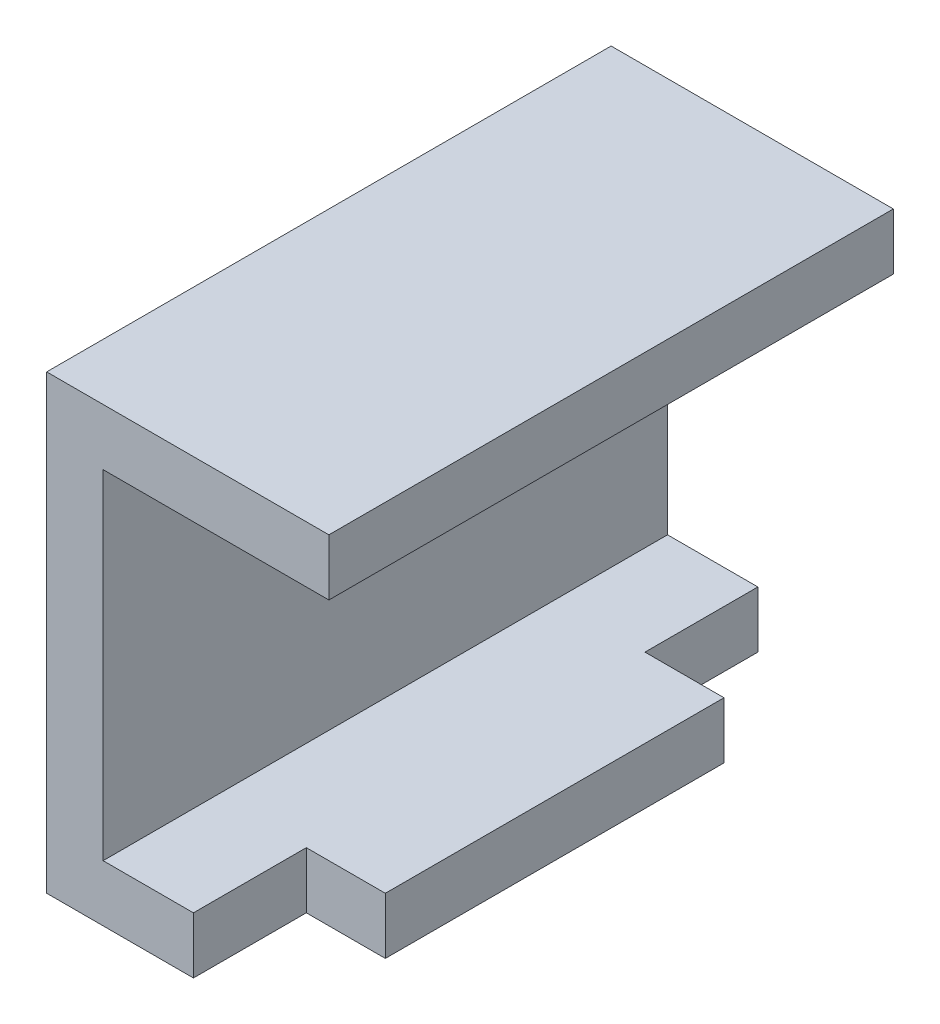
ISO-10303-21;
HEADER;
FILE_DESCRIPTION(('STEP AP214'),'2;1');
FILE_NAME('part.step','',(''),(''),'','','');
FILE_SCHEMA(('AUTOMOTIVE_DESIGN { 1 0 10303 214 1 1 1 1 }'));
ENDSEC;
DATA;
#1=APPLICATION_CONTEXT('core data for automotive mechanical design processes');
#2=APPLICATION_PROTOCOL_DEFINITION('international standard','automotive_design',2000,#1);
#3=PRODUCT_CONTEXT('',#1,'mechanical');
#4=PRODUCT('Part','Part','',(#3));
#5=PRODUCT_RELATED_PRODUCT_CATEGORY('part','',(#4));
#6=PRODUCT_DEFINITION_FORMATION('','',#4);
#7=PRODUCT_DEFINITION_CONTEXT('part definition',#1,'design');
#8=PRODUCT_DEFINITION('design','',#6,#7);
#9=PRODUCT_DEFINITION_SHAPE('','',#8);
#10=(LENGTH_UNIT() NAMED_UNIT(*) SI_UNIT(.MILLI.,.METRE.));
#11=(NAMED_UNIT(*) PLANE_ANGLE_UNIT() SI_UNIT($,.RADIAN.));
#12=(NAMED_UNIT(*) SI_UNIT($,.STERADIAN.) SOLID_ANGLE_UNIT());
#13=UNCERTAINTY_MEASURE_WITH_UNIT(LENGTH_MEASURE(1.E-05),#10,'distance_accuracy_value','');
#14=(GEOMETRIC_REPRESENTATION_CONTEXT(3) GLOBAL_UNCERTAINTY_ASSIGNED_CONTEXT((#13)) GLOBAL_UNIT_ASSIGNED_CONTEXT((#10,
#11,#12)) REPRESENTATION_CONTEXT('',''));
#15=CARTESIAN_POINT('',(0.,0.,0.));
#16=DIRECTION('',(0.,0.,1.));
#17=DIRECTION('',(1.,0.,0.));
#18=AXIS2_PLACEMENT_3D('',#15,#16,#17);
#19=CARTESIAN_POINT('',(0.01333332782721,0.,0.4));
#20=DIRECTION('',(0.,0.,-1.));
#21=DIRECTION('',(-1.,0.,0.));
#22=AXIS2_PLACEMENT_3D('',#19,#20,#21);
#23=PLANE('',#22);
#24=DIRECTION('',(0.,-1.,0.));
#25=VECTOR('',#24,1.);
#26=CARTESIAN_POINT('',(-0.05666667217279,0.,0.4));
#27=LINE('',#26,#25);
#28=CARTESIAN_POINT('',(-0.05666667217279,0.05,0.4));
#29=VERTEX_POINT('',#28);
#30=CARTESIAN_POINT('',(-0.05666667217279,0.,0.4));
#31=VERTEX_POINT('',#30);
#32=EDGE_CURVE('E126',#29,#31,#27,.T.);
#33=ORIENTED_EDGE('',*,*,#32,.T.);
#34=DIRECTION('',(1.,0.,0.));
#35=VECTOR('',#34,1.);
#36=CARTESIAN_POINT('',(-0.186666672173,0.,0.4));
#37=LINE('',#36,#35);
#38=CARTESIAN_POINT('',(0.01333332782721,0.,0.4));
#39=VERTEX_POINT('',#38);
#40=EDGE_CURVE('E109',#39,#31,#37,.F.);
#41=ORIENTED_EDGE('',*,*,#40,.F.);
#42=DIRECTION('',(0.,1.,0.));
#43=VECTOR('',#42,1.);
#44=CARTESIAN_POINT('',(0.01333332782721,0.,0.4));
#45=LINE('',#44,#43);
#46=CARTESIAN_POINT('',(0.01333332782721,0.05,0.4));
#47=VERTEX_POINT('',#46);
#48=EDGE_CURVE('E106',#47,#39,#45,.F.);
#49=ORIENTED_EDGE('',*,*,#48,.F.);
#50=DIRECTION('',(-1.,0.,0.));
#51=VECTOR('',#50,1.);
#52=CARTESIAN_POINT('',(0.01333332782721,0.05,0.4));
#53=LINE('',#52,#51);
#54=EDGE_CURVE('E103',#29,#47,#53,.F.);
#55=ORIENTED_EDGE('',*,*,#54,.F.);
#56=EDGE_LOOP('',(#33,#41,#49,#55));
#57=FACE_BOUND('',#56,.T.);
#58=ADVANCED_FACE('F17',(#57),#23,.F.);
#59=CARTESIAN_POINT('',(-0.05666667217279,0.,0.));
#60=DIRECTION('',(-1.,0.,0.));
#61=DIRECTION('',(0.,-1.,0.));
#62=AXIS2_PLACEMENT_3D('',#59,#60,#61);
#63=PLANE('',#62);
#64=DIRECTION('',(0.,1.,0.));
#65=VECTOR('',#64,1.);
#66=CARTESIAN_POINT('',(-0.05666667217279,0.,0.1));
#67=LINE('',#66,#65);
#68=CARTESIAN_POINT('',(-0.05666667217279,0.05,0.1));
#69=VERTEX_POINT('',#68);
#70=CARTESIAN_POINT('',(-0.05666667217279,0.,0.1));
#71=VERTEX_POINT('',#70);
#72=EDGE_CURVE('E20',#69,#71,#67,.F.);
#73=ORIENTED_EDGE('',*,*,#72,.T.);
#74=DIRECTION('',(0.,0.,1.));
#75=VECTOR('',#74,1.);
#76=CARTESIAN_POINT('',(-0.05666667217279,0.,0.));
#77=LINE('',#76,#75);
#78=CARTESIAN_POINT('',(-0.05666667217279,0.,0.));
#79=VERTEX_POINT('',#78);
#80=EDGE_CURVE('E162',#79,#71,#77,.T.);
#81=ORIENTED_EDGE('',*,*,#80,.F.);
#82=DIRECTION('',(0.,1.,0.));
#83=VECTOR('',#82,1.);
#84=CARTESIAN_POINT('',(-0.05666667217279,0.2109375,0.));
#85=LINE('',#84,#83);
#86=CARTESIAN_POINT('',(-0.05666667217279,0.05,0.));
#87=VERTEX_POINT('',#86);
#88=EDGE_CURVE('E152',#79,#87,#85,.T.);
#89=ORIENTED_EDGE('',*,*,#88,.T.);
#90=DIRECTION('',(0.,0.,1.));
#91=VECTOR('',#90,1.);
#92=CARTESIAN_POINT('',(-0.05666667217279,0.0499999999999999,0.));
#93=LINE('',#92,#91);
#94=EDGE_CURVE('E132',#69,#87,#93,.F.);
#95=ORIENTED_EDGE('',*,*,#94,.F.);
#96=EDGE_LOOP('',(#73,#81,#89,#95));
#97=FACE_BOUND('',#96,.T.);
#98=ADVANCED_FACE('F232',(#97),#63,.F.);
#99=CARTESIAN_POINT('',(-0.05666667217279,0.,0.1));
#100=DIRECTION('',(0.,0.,1.));
#101=DIRECTION('',(1.,0.,0.));
#102=AXIS2_PLACEMENT_3D('',#99,#100,#101);
#103=PLANE('',#102);
#104=DIRECTION('',(0.,1.,0.));
#105=VECTOR('',#104,1.);
#106=CARTESIAN_POINT('',(0.01333332782721,0.,0.1));
#107=LINE('',#106,#105);
#108=CARTESIAN_POINT('',(0.01333332782721,0.,0.1));
#109=VERTEX_POINT('',#108);
#110=CARTESIAN_POINT('',(0.01333332782721,0.05,0.1));
#111=VERTEX_POINT('',#110);
#112=EDGE_CURVE('E113',#109,#111,#107,.T.);
#113=ORIENTED_EDGE('',*,*,#112,.F.);
#114=DIRECTION('',(1.,0.,0.));
#115=VECTOR('',#114,1.);
#116=CARTESIAN_POINT('',(-0.186666672173,0.,0.1));
#117=LINE('',#116,#115);
#118=EDGE_CURVE('E165',#71,#109,#117,.T.);
#119=ORIENTED_EDGE('',*,*,#118,.F.);
#120=ORIENTED_EDGE('',*,*,#72,.F.);
#121=DIRECTION('',(-1.,0.,0.));
#122=VECTOR('',#121,1.);
#123=CARTESIAN_POINT('',(0.01333332782721,0.05,0.1));
#124=LINE('',#123,#122);
#125=EDGE_CURVE('E120',#111,#69,#124,.T.);
#126=ORIENTED_EDGE('',*,*,#125,.F.);
#127=EDGE_LOOP('',(#113,#119,#120,#126));
#128=FACE_BOUND('',#127,.T.);
#129=ADVANCED_FACE('F235',(#128),#103,.F.);
#130=CARTESIAN_POINT('',(0.01333332782721,0.,0.));
#131=DIRECTION('',(1.,0.,0.));
#132=DIRECTION('',(0.,1.,0.));
#133=AXIS2_PLACEMENT_3D('',#130,#131,#132);
#134=PLANE('',#133);
#135=ORIENTED_EDGE('',*,*,#112,.T.);
#136=DIRECTION('',(0.,0.,1.));
#137=VECTOR('',#136,1.);
#138=CARTESIAN_POINT('',(0.01333332782721,0.05,0.));
#139=LINE('',#138,#137);
#140=EDGE_CURVE('E115',#47,#111,#139,.F.);
#141=ORIENTED_EDGE('',*,*,#140,.F.);
#142=ORIENTED_EDGE('',*,*,#48,.T.);
#143=DIRECTION('',(0.,0.,1.));
#144=VECTOR('',#143,1.);
#145=CARTESIAN_POINT('',(0.01333332782721,0.,0.));
#146=LINE('',#145,#144);
#147=EDGE_CURVE('E168',#109,#39,#146,.T.);
#148=ORIENTED_EDGE('',*,*,#147,.F.);
#149=EDGE_LOOP('',(#135,#141,#142,#148));
#150=FACE_BOUND('',#149,.T.);
#151=ADVANCED_FACE('F116',(#150),#134,.T.);
#152=CARTESIAN_POINT('',(-0.05666667217279,0.,0.4));
#153=DIRECTION('',(-1.,0.,0.));
#154=DIRECTION('',(0.,-1.,0.));
#155=AXIS2_PLACEMENT_3D('',#152,#153,#154);
#156=PLANE('',#155);
#157=DIRECTION('',(0.,1.,0.));
#158=VECTOR('',#157,1.);
#159=CARTESIAN_POINT('',(-0.05666667217279,0.2109375,0.5));
#160=LINE('',#159,#158);
#161=CARTESIAN_POINT('',(-0.05666667217279,0.,0.5));
#162=VERTEX_POINT('',#161);
#163=CARTESIAN_POINT('',(-0.05666667217279,0.05,0.5));
#164=VERTEX_POINT('',#163);
#165=EDGE_CURVE('E170',#162,#164,#160,.T.);
#166=ORIENTED_EDGE('',*,*,#165,.F.);
#167=DIRECTION('',(0.,0.,1.));
#168=VECTOR('',#167,1.);
#169=CARTESIAN_POINT('',(-0.05666667217279,0.,0.));
#170=LINE('',#169,#168);
#171=EDGE_CURVE('E156',#31,#162,#170,.T.);
#172=ORIENTED_EDGE('',*,*,#171,.F.);
#173=ORIENTED_EDGE('',*,*,#32,.F.);
#174=DIRECTION('',(0.,0.,1.));
#175=VECTOR('',#174,1.);
#176=CARTESIAN_POINT('',(-0.05666667217279,0.0499999999999999,0.));
#177=LINE('',#176,#175);
#178=EDGE_CURVE('E125',#164,#29,#177,.F.);
#179=ORIENTED_EDGE('',*,*,#178,.F.);
#180=EDGE_LOOP('',(#166,#172,#173,#179));
#181=FACE_BOUND('',#180,.T.);
#182=ADVANCED_FACE('F209',(#181),#156,.F.);
#183=CARTESIAN_POINT('',(0.01333332782721,0.05,0.));
#184=DIRECTION('',(0.,1.,0.));
#185=DIRECTION('',(-1.,0.,0.));
#186=AXIS2_PLACEMENT_3D('',#183,#184,#185);
#187=PLANE('',#186);
#188=DIRECTION('',(1.,0.,0.));
#189=VECTOR('',#188,1.);
#190=CARTESIAN_POINT('',(-0.100729172173,0.05,0.5));
#191=LINE('',#190,#189);
#192=CARTESIAN_POINT('',(-0.136666672173,0.0499999999999999,0.5));
#193=VERTEX_POINT('',#192);
#194=EDGE_CURVE('E173',#164,#193,#191,.F.);
#195=ORIENTED_EDGE('',*,*,#194,.F.);
#196=ORIENTED_EDGE('',*,*,#178,.T.);
#197=ORIENTED_EDGE('',*,*,#54,.T.);
#198=ORIENTED_EDGE('',*,*,#140,.T.);
#199=ORIENTED_EDGE('',*,*,#125,.T.);
#200=ORIENTED_EDGE('',*,*,#94,.T.);
#201=DIRECTION('',(1.,0.,0.));
#202=VECTOR('',#201,1.);
#203=CARTESIAN_POINT('',(-0.100729172173,0.05,0.));
#204=LINE('',#203,#202);
#205=CARTESIAN_POINT('',(-0.136666672173,0.0499999999999999,0.));
#206=VERTEX_POINT('',#205);
#207=EDGE_CURVE('E144',#87,#206,#204,.F.);
#208=ORIENTED_EDGE('',*,*,#207,.T.);
#209=DIRECTION('',(0.,0.,1.));
#210=VECTOR('',#209,1.);
#211=CARTESIAN_POINT('',(-0.136666672173,0.05,0.));
#212=LINE('',#211,#210);
#213=EDGE_CURVE('E135',#193,#206,#212,.F.);
#214=ORIENTED_EDGE('',*,*,#213,.F.);
#215=EDGE_LOOP('',(#195,#196,#197,#198,#199,#200,#208,#214));
#216=FACE_BOUND('',#215,.T.);
#217=ADVANCED_FACE('F124',(#216),#187,.T.);
#218=CARTESIAN_POINT('',(-0.136666672173,0.05,0.));
#219=DIRECTION('',(1.,0.,0.));
#220=DIRECTION('',(0.,1.,0.));
#221=AXIS2_PLACEMENT_3D('',#218,#219,#220);
#222=PLANE('',#221);
#223=DIRECTION('',(0.,1.,0.));
#224=VECTOR('',#223,1.);
#225=CARTESIAN_POINT('',(-0.136666672173,0.2109375,0.5));
#226=LINE('',#225,#224);
#227=CARTESIAN_POINT('',(-0.136666672173,0.35,0.5));
#228=VERTEX_POINT('',#227);
#229=EDGE_CURVE('E176',#193,#228,#226,.T.);
#230=ORIENTED_EDGE('',*,*,#229,.F.);
#231=ORIENTED_EDGE('',*,*,#213,.T.);
#232=DIRECTION('',(0.,1.,0.));
#233=VECTOR('',#232,1.);
#234=CARTESIAN_POINT('',(-0.136666672173,0.2109375,0.));
#235=LINE('',#234,#233);
#236=CARTESIAN_POINT('',(-0.136666672173,0.35,0.));
#237=VERTEX_POINT('',#236);
#238=EDGE_CURVE('E146',#206,#237,#235,.T.);
#239=ORIENTED_EDGE('',*,*,#238,.T.);
#240=DIRECTION('',(0.,0.,1.));
#241=VECTOR('',#240,1.);
#242=CARTESIAN_POINT('',(-0.136666672173,0.35,0.));
#243=LINE('',#242,#241);
#244=EDGE_CURVE('E138',#228,#237,#243,.F.);
#245=ORIENTED_EDGE('',*,*,#244,.F.);
#246=EDGE_LOOP('',(#230,#231,#239,#245));
#247=FACE_BOUND('',#246,.T.);
#248=ADVANCED_FACE('F213',(#247),#222,.T.);
#249=CARTESIAN_POINT('',(-0.136666672173,0.35,0.));
#250=DIRECTION('',(0.,-1.,0.));
#251=DIRECTION('',(1.,0.,0.));
#252=AXIS2_PLACEMENT_3D('',#249,#250,#251);
#253=PLANE('',#252);
#254=DIRECTION('',(1.,0.,0.));
#255=VECTOR('',#254,1.);
#256=CARTESIAN_POINT('',(-0.100729172173,0.35,0.5));
#257=LINE('',#256,#255);
#258=CARTESIAN_POINT('',(0.06333332782721,0.35,0.5));
#259=VERTEX_POINT('',#258);
#260=EDGE_CURVE('E179',#228,#259,#257,.T.);
#261=ORIENTED_EDGE('',*,*,#260,.F.);
#262=ORIENTED_EDGE('',*,*,#244,.T.);
#263=DIRECTION('',(1.,0.,0.));
#264=VECTOR('',#263,1.);
#265=CARTESIAN_POINT('',(-0.100729172173,0.35,0.));
#266=LINE('',#265,#264);
#267=CARTESIAN_POINT('',(0.06333332782721,0.35,0.));
#268=VERTEX_POINT('',#267);
#269=EDGE_CURVE('E148',#237,#268,#266,.T.);
#270=ORIENTED_EDGE('',*,*,#269,.T.);
#271=DIRECTION('',(0.,0.,1.));
#272=VECTOR('',#271,1.);
#273=CARTESIAN_POINT('',(0.06333332782721,0.35,0.));
#274=LINE('',#273,#272);
#275=EDGE_CURVE('E141',#259,#268,#274,.F.);
#276=ORIENTED_EDGE('',*,*,#275,.F.);
#277=EDGE_LOOP('',(#261,#262,#270,#276));
#278=FACE_BOUND('',#277,.T.);
#279=ADVANCED_FACE('F217',(#278),#253,.T.);
#280=CARTESIAN_POINT('',(0.06333332782721,0.35,0.));
#281=DIRECTION('',(1.,0.,0.));
#282=DIRECTION('',(0.,1.,0.));
#283=AXIS2_PLACEMENT_3D('',#280,#281,#282);
#284=PLANE('',#283);
#285=DIRECTION('',(0.,1.,0.));
#286=VECTOR('',#285,1.);
#287=CARTESIAN_POINT('',(0.06333332782721,0.2109375,0.5));
#288=LINE('',#287,#286);
#289=CARTESIAN_POINT('',(0.06333332782721,0.4,0.5));
#290=VERTEX_POINT('',#289);
#291=EDGE_CURVE('E182',#259,#290,#288,.T.);
#292=ORIENTED_EDGE('',*,*,#291,.F.);
#293=ORIENTED_EDGE('',*,*,#275,.T.);
#294=DIRECTION('',(0.,1.,0.));
#295=VECTOR('',#294,1.);
#296=CARTESIAN_POINT('',(0.06333332782721,0.2109375,0.));
#297=LINE('',#296,#295);
#298=CARTESIAN_POINT('',(0.06333332782721,0.4,0.));
#299=VERTEX_POINT('',#298);
#300=EDGE_CURVE('E150',#268,#299,#297,.T.);
#301=ORIENTED_EDGE('',*,*,#300,.T.);
#302=DIRECTION('',(0.,0.,1.));
#303=VECTOR('',#302,1.);
#304=CARTESIAN_POINT('',(0.06333332782721,0.4,0.));
#305=LINE('',#304,#303);
#306=EDGE_CURVE('E191',#290,#299,#305,.F.);
#307=ORIENTED_EDGE('',*,*,#306,.F.);
#308=EDGE_LOOP('',(#292,#293,#301,#307));
#309=FACE_BOUND('',#308,.T.);
#310=ADVANCED_FACE('F222',(#309),#284,.T.);
#311=CARTESIAN_POINT('',(-0.100729172173,0.2109375,0.));
#312=DIRECTION('',(0.,0.,1.));
#313=DIRECTION('',(1.,0.,0.));
#314=AXIS2_PLACEMENT_3D('',#311,#312,#313);
#315=PLANE('',#314);
#316=DIRECTION('',(1.,0.,0.));
#317=VECTOR('',#316,1.);
#318=CARTESIAN_POINT('',(-0.186666672173,0.,0.));
#319=LINE('',#318,#317);
#320=CARTESIAN_POINT('',(-0.186666672173,0.,0.));
#321=VERTEX_POINT('',#320);
#322=EDGE_CURVE('E159',#321,#79,#319,.T.);
#323=ORIENTED_EDGE('',*,*,#322,.F.);
#324=DIRECTION('',(0.,-1.,0.));
#325=VECTOR('',#324,1.);
#326=CARTESIAN_POINT('',(-0.186666672173,0.4,0.));
#327=LINE('',#326,#325);
#328=CARTESIAN_POINT('',(-0.186666672173,0.4,0.));
#329=VERTEX_POINT('',#328);
#330=EDGE_CURVE('E194',#329,#321,#327,.T.);
#331=ORIENTED_EDGE('',*,*,#330,.F.);
#332=DIRECTION('',(-1.,0.,0.));
#333=VECTOR('',#332,1.);
#334=CARTESIAN_POINT('',(0.06333332782721,0.4,0.));
#335=LINE('',#334,#333);
#336=EDGE_CURVE('E187',#299,#329,#335,.T.);
#337=ORIENTED_EDGE('',*,*,#336,.F.);
#338=ORIENTED_EDGE('',*,*,#300,.F.);
#339=ORIENTED_EDGE('',*,*,#269,.F.);
#340=ORIENTED_EDGE('',*,*,#238,.F.);
#341=ORIENTED_EDGE('',*,*,#207,.F.);
#342=ORIENTED_EDGE('',*,*,#88,.F.);
#343=EDGE_LOOP('',(#323,#331,#337,#338,#339,#340,#341,#342));
#344=FACE_BOUND('',#343,.T.);
#345=ADVANCED_FACE('F227',(#344),#315,.F.);
#346=CARTESIAN_POINT('',(-0.186666672173,0.,0.));
#347=DIRECTION('',(0.,-1.,0.));
#348=DIRECTION('',(1.,0.,0.));
#349=AXIS2_PLACEMENT_3D('',#346,#347,#348);
#350=PLANE('',#349);
#351=ORIENTED_EDGE('',*,*,#118,.T.);
#352=ORIENTED_EDGE('',*,*,#147,.T.);
#353=ORIENTED_EDGE('',*,*,#40,.T.);
#354=ORIENTED_EDGE('',*,*,#171,.T.);
#355=DIRECTION('',(1.,0.,0.));
#356=VECTOR('',#355,1.);
#357=CARTESIAN_POINT('',(-0.100729172173,0.,0.5));
#358=LINE('',#357,#356);
#359=CARTESIAN_POINT('',(-0.186666672173,0.,0.5));
#360=VERTEX_POINT('',#359);
#361=EDGE_CURVE('E184',#360,#162,#358,.T.);
#362=ORIENTED_EDGE('',*,*,#361,.F.);
#363=DIRECTION('',(0.,0.,1.));
#364=VECTOR('',#363,1.);
#365=CARTESIAN_POINT('',(-0.186666672173,0.,0.));
#366=LINE('',#365,#364);
#367=EDGE_CURVE('E197',#321,#360,#366,.T.);
#368=ORIENTED_EDGE('',*,*,#367,.F.);
#369=ORIENTED_EDGE('',*,*,#322,.T.);
#370=ORIENTED_EDGE('',*,*,#80,.T.);
#371=EDGE_LOOP('',(#351,#352,#353,#354,#362,#368,#369,#370));
#372=FACE_BOUND('',#371,.T.);
#373=ADVANCED_FACE('F206',(#372),#350,.T.);
#374=CARTESIAN_POINT('',(-0.100729172173,0.2109375,0.5));
#375=DIRECTION('',(0.,0.,1.));
#376=DIRECTION('',(1.,0.,0.));
#377=AXIS2_PLACEMENT_3D('',#374,#375,#376);
#378=PLANE('',#377);
#379=DIRECTION('',(0.,-1.,0.));
#380=VECTOR('',#379,1.);
#381=CARTESIAN_POINT('',(-0.186666672173,0.4,0.5));
#382=LINE('',#381,#380);
#383=CARTESIAN_POINT('',(-0.186666672173,0.4,0.5));
#384=VERTEX_POINT('',#383);
#385=EDGE_CURVE('E26',#360,#384,#382,.F.);
#386=ORIENTED_EDGE('',*,*,#385,.F.);
#387=ORIENTED_EDGE('',*,*,#361,.T.);
#388=ORIENTED_EDGE('',*,*,#165,.T.);
#389=ORIENTED_EDGE('',*,*,#194,.T.);
#390=ORIENTED_EDGE('',*,*,#229,.T.);
#391=ORIENTED_EDGE('',*,*,#260,.T.);
#392=ORIENTED_EDGE('',*,*,#291,.T.);
#393=DIRECTION('',(-1.,0.,0.));
#394=VECTOR('',#393,1.);
#395=CARTESIAN_POINT('',(0.06333332782721,0.4,0.5));
#396=LINE('',#395,#394);
#397=EDGE_CURVE('E35',#384,#290,#396,.F.);
#398=ORIENTED_EDGE('',*,*,#397,.F.);
#399=EDGE_LOOP('',(#386,#387,#388,#389,#390,#391,#392,#398));
#400=FACE_BOUND('',#399,.T.);
#401=ADVANCED_FACE('F204',(#400),#378,.T.);
#402=CARTESIAN_POINT('',(0.06333332782721,0.4,0.));
#403=DIRECTION('',(0.,1.,0.));
#404=DIRECTION('',(-1.,0.,0.));
#405=AXIS2_PLACEMENT_3D('',#402,#403,#404);
#406=PLANE('',#405);
#407=ORIENTED_EDGE('',*,*,#397,.T.);
#408=ORIENTED_EDGE('',*,*,#306,.T.);
#409=ORIENTED_EDGE('',*,*,#336,.T.);
#410=DIRECTION('',(0.,0.,1.));
#411=VECTOR('',#410,1.);
#412=CARTESIAN_POINT('',(-0.186666672173,0.4,0.));
#413=LINE('',#412,#411);
#414=EDGE_CURVE('E11',#384,#329,#413,.F.);
#415=ORIENTED_EDGE('',*,*,#414,.F.);
#416=EDGE_LOOP('',(#407,#408,#409,#415));
#417=FACE_BOUND('',#416,.T.);
#418=ADVANCED_FACE('F225',(#417),#406,.T.);
#419=CARTESIAN_POINT('',(-0.186666672173,0.4,0.));
#420=DIRECTION('',(-1.,0.,0.));
#421=DIRECTION('',(0.,-1.,0.));
#422=AXIS2_PLACEMENT_3D('',#419,#420,#421);
#423=PLANE('',#422);
#424=ORIENTED_EDGE('',*,*,#385,.T.);
#425=ORIENTED_EDGE('',*,*,#414,.T.);
#426=ORIENTED_EDGE('',*,*,#330,.T.);
#427=ORIENTED_EDGE('',*,*,#367,.T.);
#428=EDGE_LOOP('',(#424,#425,#426,#427));
#429=FACE_BOUND('',#428,.T.);
#430=ADVANCED_FACE('F202',(#429),#423,.T.);
#431=CLOSED_SHELL('',(#58,#98,#129,#151,#182,#217,#248,#279,#310,#345,#373,#401,#418,#430));
#432=MANIFOLD_SOLID_BREP('B1',#431);
#433=ADVANCED_BREP_SHAPE_REPRESENTATION('',(#18,#432),#14);
#434=SHAPE_DEFINITION_REPRESENTATION(#9,#433);
ENDSEC;
END-ISO-10303-21;
